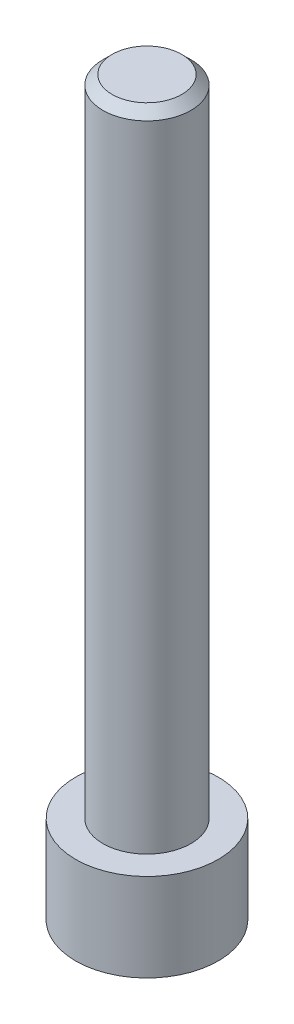
ISO-10303-21;
HEADER;
FILE_DESCRIPTION(('STEP AP214'),'2;1');
FILE_NAME('part.step','',(''),(''),'','','');
FILE_SCHEMA(('AUTOMOTIVE_DESIGN { 1 0 10303 214 1 1 1 1 }'));
ENDSEC;
DATA;
#1=APPLICATION_CONTEXT('core data for automotive mechanical design processes');
#2=APPLICATION_PROTOCOL_DEFINITION('international standard','automotive_design',2000,#1);
#3=PRODUCT_CONTEXT('',#1,'mechanical');
#4=PRODUCT('Part','Part','',(#3));
#5=PRODUCT_RELATED_PRODUCT_CATEGORY('part','',(#4));
#6=PRODUCT_DEFINITION_FORMATION('','',#4);
#7=PRODUCT_DEFINITION_CONTEXT('part definition',#1,'design');
#8=PRODUCT_DEFINITION('design','',#6,#7);
#9=PRODUCT_DEFINITION_SHAPE('','',#8);
#10=(LENGTH_UNIT() NAMED_UNIT(*) SI_UNIT(.MILLI.,.METRE.));
#11=(NAMED_UNIT(*) PLANE_ANGLE_UNIT() SI_UNIT($,.RADIAN.));
#12=(NAMED_UNIT(*) SI_UNIT($,.STERADIAN.) SOLID_ANGLE_UNIT());
#13=UNCERTAINTY_MEASURE_WITH_UNIT(LENGTH_MEASURE(1.E-05),#10,'distance_accuracy_value','');
#14=(GEOMETRIC_REPRESENTATION_CONTEXT(3) GLOBAL_UNCERTAINTY_ASSIGNED_CONTEXT((#13)) GLOBAL_UNIT_ASSIGNED_CONTEXT((#10,
#11,#12)) REPRESENTATION_CONTEXT('',''));
#15=CARTESIAN_POINT('',(0.,0.,0.));
#16=DIRECTION('',(0.,0.,1.));
#17=DIRECTION('',(1.,0.,0.));
#18=AXIS2_PLACEMENT_3D('',#15,#16,#17);
#19=CARTESIAN_POINT('',(0.,39.78,0.));
#20=DIRECTION('',(0.,-1.,0.));
#21=DIRECTION('',(0.,0.,-1.));
#22=AXIS2_PLACEMENT_3D('',#19,#20,#21);
#23=CYLINDRICAL_SURFACE('',#22,3.875);
#24=CARTESIAN_POINT('',(0.,0.,0.));
#25=DIRECTION('',(0.,1.,0.));
#26=DIRECTION('',(0.,0.,1.));
#27=AXIS2_PLACEMENT_3D('',#24,#25,#26);
#28=CIRCLE('',#27,3.875);
#29=CARTESIAN_POINT('',(0.,0.,3.875));
#30=VERTEX_POINT('',#29);
#31=EDGE_CURVE('E146',#30,#30,#28,.T.);
#32=ORIENTED_EDGE('',*,*,#31,.T.);
#33=EDGE_LOOP('',(#32));
#34=FACE_BOUND('',#33,.T.);
#35=CARTESIAN_POINT('',(0.,4.78,0.));
#36=DIRECTION('',(0.,1.,0.));
#37=DIRECTION('',(0.,0.,1.));
#38=AXIS2_PLACEMENT_3D('',#35,#36,#37);
#39=CIRCLE('',#38,3.875);
#40=CARTESIAN_POINT('',(0.,4.78,3.875));
#41=VERTEX_POINT('',#40);
#42=EDGE_CURVE('E145',#41,#41,#39,.T.);
#43=ORIENTED_EDGE('',*,*,#42,.F.);
#44=EDGE_LOOP('',(#43));
#45=FACE_BOUND('',#44,.T.);
#46=ADVANCED_FACE('F35',(#34,#45),#23,.T.);
#47=CARTESIAN_POINT('',(0.,0.,0.));
#48=DIRECTION('',(0.,1.,0.));
#49=DIRECTION('',(0.,0.,1.));
#50=AXIS2_PLACEMENT_3D('',#47,#48,#49);
#51=PLANE('',#50);
#52=DIRECTION('',(-0.5,0.,0.866025403784439));
#53=VECTOR('',#52,1.);
#54=CARTESIAN_POINT('',(2.64426423288849,0.,0.));
#55=LINE('',#54,#53);
#56=CARTESIAN_POINT('',(2.64426423288849,0.,0.));
#57=VERTEX_POINT('',#56);
#58=CARTESIAN_POINT('',(1.32213211644424,0.,2.29));
#59=VERTEX_POINT('',#58);
#60=EDGE_CURVE('E124',#57,#59,#55,.T.);
#61=ORIENTED_EDGE('',*,*,#60,.F.);
#62=DIRECTION('',(0.5,0.,0.866025403784439));
#63=VECTOR('',#62,1.);
#64=CARTESIAN_POINT('',(1.32213211644424,0.,-2.29));
#65=LINE('',#64,#63);
#66=CARTESIAN_POINT('',(1.32213211644424,0.,-2.29));
#67=VERTEX_POINT('',#66);
#68=EDGE_CURVE('E50',#67,#57,#65,.T.);
#69=ORIENTED_EDGE('',*,*,#68,.F.);
#70=DIRECTION('',(1.,0.,0.));
#71=VECTOR('',#70,1.);
#72=CARTESIAN_POINT('',(-1.32213211644424,0.,-2.29));
#73=LINE('',#72,#71);
#74=CARTESIAN_POINT('',(-1.32213211644424,0.,-2.29));
#75=VERTEX_POINT('',#74);
#76=EDGE_CURVE('E133',#75,#67,#73,.T.);
#77=ORIENTED_EDGE('',*,*,#76,.F.);
#78=DIRECTION('',(0.5,0.,-0.866025403784439));
#79=VECTOR('',#78,1.);
#80=CARTESIAN_POINT('',(-2.64426423288849,0.,0.));
#81=LINE('',#80,#79);
#82=CARTESIAN_POINT('',(-2.64426423288849,0.,0.));
#83=VERTEX_POINT('',#82);
#84=EDGE_CURVE('E131',#83,#75,#81,.T.);
#85=ORIENTED_EDGE('',*,*,#84,.F.);
#86=DIRECTION('',(-0.5,0.,-0.866025403784439));
#87=VECTOR('',#86,1.);
#88=CARTESIAN_POINT('',(-1.32213211644424,0.,2.29));
#89=LINE('',#88,#87);
#90=CARTESIAN_POINT('',(-1.32213211644424,0.,2.29));
#91=VERTEX_POINT('',#90);
#92=EDGE_CURVE('E98',#91,#83,#89,.T.);
#93=ORIENTED_EDGE('',*,*,#92,.F.);
#94=DIRECTION('',(-1.,0.,0.));
#95=VECTOR('',#94,1.);
#96=CARTESIAN_POINT('',(1.32213211644424,0.,2.29));
#97=LINE('',#96,#95);
#98=EDGE_CURVE('E127',#59,#91,#97,.T.);
#99=ORIENTED_EDGE('',*,*,#98,.F.);
#100=EDGE_LOOP('',(#61,#69,#77,#85,#93,#99));
#101=FACE_BOUND('',#100,.T.);
#102=ORIENTED_EDGE('',*,*,#31,.F.);
#103=EDGE_LOOP('',(#102));
#104=FACE_BOUND('',#103,.T.);
#105=ADVANCED_FACE('F168',(#101,#104),#51,.F.);
#106=CARTESIAN_POINT('',(0.,4.78,0.));
#107=DIRECTION('',(0.,1.,0.));
#108=DIRECTION('',(0.,0.,1.));
#109=AXIS2_PLACEMENT_3D('',#106,#107,#108);
#110=PLANE('',#109);
#111=CARTESIAN_POINT('',(0.,4.78,0.));
#112=DIRECTION('',(0.,1.,0.));
#113=DIRECTION('',(0.,0.,1.));
#114=AXIS2_PLACEMENT_3D('',#111,#112,#113);
#115=CIRCLE('',#114,2.39);
#116=CARTESIAN_POINT('',(0.,4.78,2.39));
#117=VERTEX_POINT('',#116);
#118=EDGE_CURVE('E137',#117,#117,#115,.T.);
#119=ORIENTED_EDGE('',*,*,#118,.F.);
#120=EDGE_LOOP('',(#119));
#121=FACE_BOUND('',#120,.T.);
#122=ORIENTED_EDGE('',*,*,#42,.T.);
#123=EDGE_LOOP('',(#122));
#124=FACE_BOUND('',#123,.T.);
#125=ADVANCED_FACE('F173',(#121,#124),#110,.T.);
#126=CARTESIAN_POINT('',(0.,4.78,0.));
#127=DIRECTION('',(0.,1.,0.));
#128=DIRECTION('',(0.,0.,1.));
#129=AXIS2_PLACEMENT_3D('',#126,#127,#128);
#130=CYLINDRICAL_SURFACE('',#129,2.39);
#131=CARTESIAN_POINT('',(0.,39.28,0.));
#132=DIRECTION('',(0.,1.,0.));
#133=DIRECTION('',(0.,0.,1.));
#134=AXIS2_PLACEMENT_3D('',#131,#132,#133);
#135=CIRCLE('',#134,2.39);
#136=CARTESIAN_POINT('',(0.,39.28,2.39));
#137=VERTEX_POINT('',#136);
#138=EDGE_CURVE('E12',#137,#137,#135,.F.);
#139=ORIENTED_EDGE('',*,*,#138,.T.);
#140=EDGE_LOOP('',(#139));
#141=FACE_BOUND('',#140,.T.);
#142=ORIENTED_EDGE('',*,*,#118,.T.);
#143=EDGE_LOOP('',(#142));
#144=FACE_BOUND('',#143,.T.);
#145=ADVANCED_FACE('F164',(#141,#144),#130,.T.);
#146=CARTESIAN_POINT('',(0.,39.78,0.));
#147=DIRECTION('',(0.,1.,0.));
#148=DIRECTION('',(0.,0.,1.));
#149=AXIS2_PLACEMENT_3D('',#146,#147,#148);
#150=PLANE('',#149);
#151=CARTESIAN_POINT('',(0.,39.78,0.));
#152=DIRECTION('',(0.,1.,0.));
#153=DIRECTION('',(0.,0.,1.));
#154=AXIS2_PLACEMENT_3D('',#151,#152,#153);
#155=CIRCLE('',#154,1.89);
#156=CARTESIAN_POINT('',(0.,39.78,1.89));
#157=VERTEX_POINT('',#156);
#158=EDGE_CURVE('E43',#157,#157,#155,.T.);
#159=ORIENTED_EDGE('',*,*,#158,.T.);
#160=EDGE_LOOP('',(#159));
#161=FACE_BOUND('',#160,.T.);
#162=ADVANCED_FACE('F153',(#161),#150,.T.);
#163=CARTESIAN_POINT('',(0.,39.78,0.));
#164=DIRECTION('',(0.,-1.,0.));
#165=DIRECTION('',(0.,0.,-1.));
#166=AXIS2_PLACEMENT_3D('',#163,#164,#165);
#167=CONICAL_SURFACE('',#166,1.89,0.785398163397452);
#168=ORIENTED_EDGE('',*,*,#138,.F.);
#169=EDGE_LOOP('',(#168));
#170=FACE_BOUND('',#169,.T.);
#171=ORIENTED_EDGE('',*,*,#158,.F.);
#172=EDGE_LOOP('',(#171));
#173=FACE_BOUND('',#172,.T.);
#174=ADVANCED_FACE('F37',(#170,#173),#167,.T.);
#175=CARTESIAN_POINT('',(1.32213211644424,3.36,-2.29));
#176=DIRECTION('',(0.866025403784439,0.,-0.5));
#177=DIRECTION('',(-0.5,0.,-0.866025403784439));
#178=AXIS2_PLACEMENT_3D('',#175,#176,#177);
#179=PLANE('',#178);
#180=ORIENTED_EDGE('',*,*,#68,.T.);
#181=DIRECTION('',(0.,-1.,0.));
#182=VECTOR('',#181,1.);
#183=CARTESIAN_POINT('',(2.64426423288849,3.36,0.));
#184=LINE('',#183,#182);
#185=CARTESIAN_POINT('',(2.64426423288849,3.36,0.));
#186=VERTEX_POINT('',#185);
#187=EDGE_CURVE('E80',#186,#57,#184,.T.);
#188=ORIENTED_EDGE('',*,*,#187,.F.);
#189=DIRECTION('',(0.5,0.,0.866025403784439));
#190=VECTOR('',#189,1.);
#191=CARTESIAN_POINT('',(1.32213211644424,3.36,-2.29));
#192=LINE('',#191,#190);
#193=CARTESIAN_POINT('',(1.32213211644424,3.36,-2.29));
#194=VERTEX_POINT('',#193);
#195=EDGE_CURVE('E135',#194,#186,#192,.T.);
#196=ORIENTED_EDGE('',*,*,#195,.F.);
#197=DIRECTION('',(0.,-1.,0.));
#198=VECTOR('',#197,1.);
#199=CARTESIAN_POINT('',(1.32213211644424,3.36,-2.29));
#200=LINE('',#199,#198);
#201=EDGE_CURVE('E58',#194,#67,#200,.T.);
#202=ORIENTED_EDGE('',*,*,#201,.T.);
#203=EDGE_LOOP('',(#180,#188,#196,#202));
#204=FACE_BOUND('',#203,.T.);
#205=ADVANCED_FACE('F156',(#204),#179,.F.);
#206=CARTESIAN_POINT('',(-1.32213211644424,3.36,-2.29));
#207=DIRECTION('',(0.,0.,-1.));
#208=DIRECTION('',(-1.,0.,0.));
#209=AXIS2_PLACEMENT_3D('',#206,#207,#208);
#210=PLANE('',#209);
#211=ORIENTED_EDGE('',*,*,#76,.T.);
#212=ORIENTED_EDGE('',*,*,#201,.F.);
#213=DIRECTION('',(1.,0.,0.));
#214=VECTOR('',#213,1.);
#215=CARTESIAN_POINT('',(-1.32213211644424,3.36,-2.29));
#216=LINE('',#215,#214);
#217=CARTESIAN_POINT('',(-1.32213211644424,3.36,-2.29));
#218=VERTEX_POINT('',#217);
#219=EDGE_CURVE('E110',#218,#194,#216,.T.);
#220=ORIENTED_EDGE('',*,*,#219,.F.);
#221=DIRECTION('',(0.,-1.,0.));
#222=VECTOR('',#221,1.);
#223=CARTESIAN_POINT('',(-1.32213211644424,3.36,-2.29));
#224=LINE('',#223,#222);
#225=EDGE_CURVE('E102',#218,#75,#224,.T.);
#226=ORIENTED_EDGE('',*,*,#225,.T.);
#227=EDGE_LOOP('',(#211,#212,#220,#226));
#228=FACE_BOUND('',#227,.T.);
#229=ADVANCED_FACE('F162',(#228),#210,.F.);
#230=CARTESIAN_POINT('',(-2.64426423288849,3.36,0.));
#231=DIRECTION('',(-0.866025403784438,0.,-0.5));
#232=DIRECTION('',(-0.5,0.,0.866025403784439));
#233=AXIS2_PLACEMENT_3D('',#230,#231,#232);
#234=PLANE('',#233);
#235=ORIENTED_EDGE('',*,*,#84,.T.);
#236=ORIENTED_EDGE('',*,*,#225,.F.);
#237=DIRECTION('',(0.5,0.,-0.866025403784439));
#238=VECTOR('',#237,1.);
#239=CARTESIAN_POINT('',(-2.64426423288849,3.36,0.));
#240=LINE('',#239,#238);
#241=CARTESIAN_POINT('',(-2.64426423288849,3.36,0.));
#242=VERTEX_POINT('',#241);
#243=EDGE_CURVE('E106',#242,#218,#240,.T.);
#244=ORIENTED_EDGE('',*,*,#243,.F.);
#245=DIRECTION('',(0.,-1.,0.));
#246=VECTOR('',#245,1.);
#247=CARTESIAN_POINT('',(-2.64426423288849,3.36,0.));
#248=LINE('',#247,#246);
#249=EDGE_CURVE('E91',#242,#83,#248,.T.);
#250=ORIENTED_EDGE('',*,*,#249,.T.);
#251=EDGE_LOOP('',(#235,#236,#244,#250));
#252=FACE_BOUND('',#251,.T.);
#253=ADVANCED_FACE('F107',(#252),#234,.F.);
#254=CARTESIAN_POINT('',(-1.32213211644424,3.36,2.29));
#255=DIRECTION('',(-0.866025403784439,0.,0.5));
#256=DIRECTION('',(0.5,0.,0.866025403784439));
#257=AXIS2_PLACEMENT_3D('',#254,#255,#256);
#258=PLANE('',#257);
#259=ORIENTED_EDGE('',*,*,#92,.T.);
#260=ORIENTED_EDGE('',*,*,#249,.F.);
#261=DIRECTION('',(-0.5,0.,-0.866025403784439));
#262=VECTOR('',#261,1.);
#263=CARTESIAN_POINT('',(-1.32213211644424,3.36,2.29));
#264=LINE('',#263,#262);
#265=CARTESIAN_POINT('',(-1.32213211644424,3.36,2.29));
#266=VERTEX_POINT('',#265);
#267=EDGE_CURVE('E95',#266,#242,#264,.T.);
#268=ORIENTED_EDGE('',*,*,#267,.F.);
#269=DIRECTION('',(0.,-1.,0.));
#270=VECTOR('',#269,1.);
#271=CARTESIAN_POINT('',(-1.32213211644424,3.36,2.29));
#272=LINE('',#271,#270);
#273=EDGE_CURVE('E103',#266,#91,#272,.T.);
#274=ORIENTED_EDGE('',*,*,#273,.T.);
#275=EDGE_LOOP('',(#259,#260,#268,#274));
#276=FACE_BOUND('',#275,.T.);
#277=ADVANCED_FACE('F93',(#276),#258,.F.);
#278=CARTESIAN_POINT('',(1.32213211644424,3.36,2.29));
#279=DIRECTION('',(0.,0.,1.));
#280=DIRECTION('',(1.,0.,0.));
#281=AXIS2_PLACEMENT_3D('',#278,#279,#280);
#282=PLANE('',#281);
#283=ORIENTED_EDGE('',*,*,#98,.T.);
#284=ORIENTED_EDGE('',*,*,#273,.F.);
#285=DIRECTION('',(-1.,0.,0.));
#286=VECTOR('',#285,1.);
#287=CARTESIAN_POINT('',(1.32213211644424,3.36,2.29));
#288=LINE('',#287,#286);
#289=CARTESIAN_POINT('',(1.32213211644424,3.36,2.29));
#290=VERTEX_POINT('',#289);
#291=EDGE_CURVE('E116',#290,#266,#288,.T.);
#292=ORIENTED_EDGE('',*,*,#291,.F.);
#293=DIRECTION('',(0.,-1.,0.));
#294=VECTOR('',#293,1.);
#295=CARTESIAN_POINT('',(1.32213211644424,3.36,2.29));
#296=LINE('',#295,#294);
#297=EDGE_CURVE('E140',#290,#59,#296,.T.);
#298=ORIENTED_EDGE('',*,*,#297,.T.);
#299=EDGE_LOOP('',(#283,#284,#292,#298));
#300=FACE_BOUND('',#299,.T.);
#301=ADVANCED_FACE('F187',(#300),#282,.F.);
#302=CARTESIAN_POINT('',(2.64426423288849,3.36,0.));
#303=DIRECTION('',(0.866025403784439,0.,0.5));
#304=DIRECTION('',(0.5,0.,-0.866025403784439));
#305=AXIS2_PLACEMENT_3D('',#302,#303,#304);
#306=PLANE('',#305);
#307=ORIENTED_EDGE('',*,*,#60,.T.);
#308=ORIENTED_EDGE('',*,*,#297,.F.);
#309=DIRECTION('',(-0.5,0.,0.866025403784439));
#310=VECTOR('',#309,1.);
#311=CARTESIAN_POINT('',(2.64426423288849,3.36,0.));
#312=LINE('',#311,#310);
#313=EDGE_CURVE('E118',#186,#290,#312,.T.);
#314=ORIENTED_EDGE('',*,*,#313,.F.);
#315=ORIENTED_EDGE('',*,*,#187,.T.);
#316=EDGE_LOOP('',(#307,#308,#314,#315));
#317=FACE_BOUND('',#316,.T.);
#318=ADVANCED_FACE('F184',(#317),#306,.F.);
#319=CARTESIAN_POINT('',(0.,3.36,0.));
#320=DIRECTION('',(0.,-1.,0.));
#321=DIRECTION('',(0.,0.,-1.));
#322=AXIS2_PLACEMENT_3D('',#319,#320,#321);
#323=PLANE('',#322);
#324=ORIENTED_EDGE('',*,*,#195,.T.);
#325=ORIENTED_EDGE('',*,*,#313,.T.);
#326=ORIENTED_EDGE('',*,*,#291,.T.);
#327=ORIENTED_EDGE('',*,*,#267,.T.);
#328=ORIENTED_EDGE('',*,*,#243,.T.);
#329=ORIENTED_EDGE('',*,*,#219,.T.);
#330=EDGE_LOOP('',(#324,#325,#326,#327,#328,#329));
#331=FACE_BOUND('',#330,.T.);
#332=ADVANCED_FACE('F113',(#331),#323,.T.);
#333=CLOSED_SHELL('',(#46,#105,#125,#145,#162,#174,#205,#229,#253,#277,#301,#318,#332));
#334=MANIFOLD_SOLID_BREP('B2',#333);
#335=ADVANCED_BREP_SHAPE_REPRESENTATION('',(#18,#334),#14);
#336=SHAPE_DEFINITION_REPRESENTATION(#9,#335);
ENDSEC;
END-ISO-10303-21;
